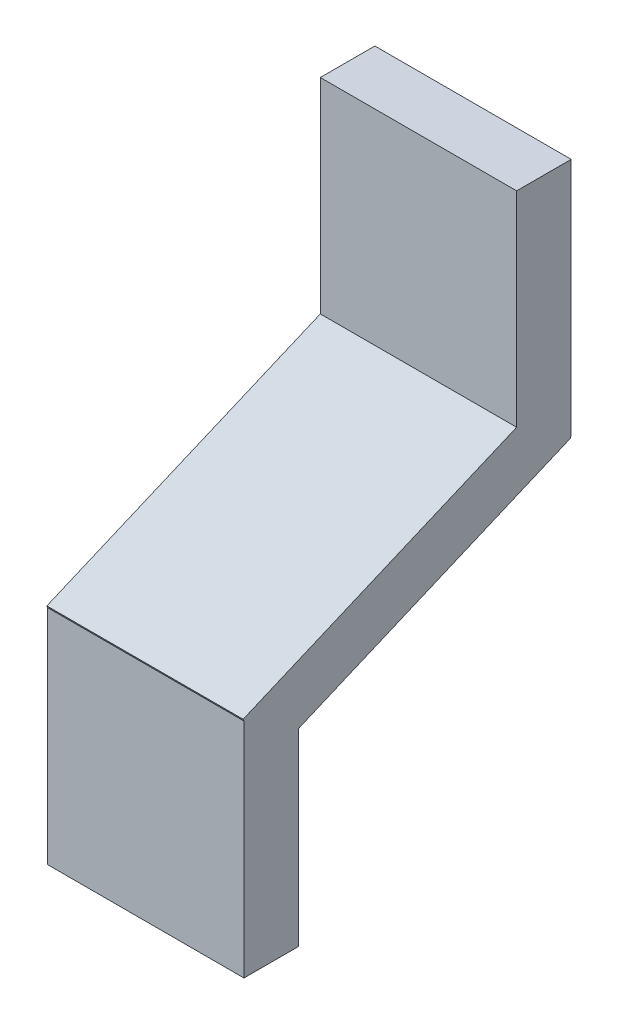
ISO-10303-21;
HEADER;
FILE_DESCRIPTION(('STEP AP214'),'2;1');
FILE_NAME('part.step','',(''),(''),'','','');
FILE_SCHEMA(('AUTOMOTIVE_DESIGN { 1 0 10303 214 1 1 1 1 }'));
ENDSEC;
DATA;
#1=APPLICATION_CONTEXT('core data for automotive mechanical design processes');
#2=APPLICATION_PROTOCOL_DEFINITION('international standard','automotive_design',2000,#1);
#3=PRODUCT_CONTEXT('',#1,'mechanical');
#4=PRODUCT('Part','Part','',(#3));
#5=PRODUCT_RELATED_PRODUCT_CATEGORY('part','',(#4));
#6=PRODUCT_DEFINITION_FORMATION('','',#4);
#7=PRODUCT_DEFINITION_CONTEXT('part definition',#1,'design');
#8=PRODUCT_DEFINITION('design','',#6,#7);
#9=PRODUCT_DEFINITION_SHAPE('','',#8);
#10=(LENGTH_UNIT() NAMED_UNIT(*) SI_UNIT(.MILLI.,.METRE.));
#11=(NAMED_UNIT(*) PLANE_ANGLE_UNIT() SI_UNIT($,.RADIAN.));
#12=(NAMED_UNIT(*) SI_UNIT($,.STERADIAN.) SOLID_ANGLE_UNIT());
#13=UNCERTAINTY_MEASURE_WITH_UNIT(LENGTH_MEASURE(1.E-05),#10,'distance_accuracy_value','');
#14=(GEOMETRIC_REPRESENTATION_CONTEXT(3) GLOBAL_UNCERTAINTY_ASSIGNED_CONTEXT((#13)) GLOBAL_UNIT_ASSIGNED_CONTEXT((#10,
#11,#12)) REPRESENTATION_CONTEXT('',''));
#15=CARTESIAN_POINT('',(0.,0.,0.));
#16=DIRECTION('',(0.,0.,1.));
#17=DIRECTION('',(1.,0.,0.));
#18=AXIS2_PLACEMENT_3D('',#15,#16,#17);
#19=CARTESIAN_POINT('',(5.82,11.,0.5));
#20=DIRECTION('',(0.,0.,1.));
#21=DIRECTION('',(1.,0.,0.));
#22=AXIS2_PLACEMENT_3D('',#19,#20,#21);
#23=PLANE('',#22);
#24=DIRECTION('',(1.,0.,0.));
#25=VECTOR('',#24,1.);
#26=CARTESIAN_POINT('',(5.82,11.3461054439247,0.500000000000314));
#27=LINE('',#26,#25);
#28=CARTESIAN_POINT('',(6.180000014305,11.3461054439242,0.500000000000105));
#29=VERTEX_POINT('',#28);
#30=CARTESIAN_POINT('',(5.82,11.3461054439243,0.500000000000105));
#31=VERTEX_POINT('',#30);
#32=EDGE_CURVE('E148',#29,#31,#27,.F.);
#33=ORIENTED_EDGE('',*,*,#32,.F.);
#34=DIRECTION('',(0.,1.,0.));
#35=VECTOR('',#34,1.);
#36=CARTESIAN_POINT('',(6.180000014305,11.65,0.5));
#37=LINE('',#36,#35);
#38=CARTESIAN_POINT('',(6.180000014305,11.,0.5));
#39=VERTEX_POINT('',#38);
#40=EDGE_CURVE('E154',#39,#29,#37,.T.);
#41=ORIENTED_EDGE('',*,*,#40,.F.);
#42=DIRECTION('',(1.,0.,0.));
#43=VECTOR('',#42,1.);
#44=CARTESIAN_POINT('',(5.82,11.,0.5));
#45=LINE('',#44,#43);
#46=CARTESIAN_POINT('',(5.82,11.,0.5));
#47=VERTEX_POINT('',#46);
#48=EDGE_CURVE('E135',#39,#47,#45,.F.);
#49=ORIENTED_EDGE('',*,*,#48,.T.);
#50=DIRECTION('',(0.,1.,0.));
#51=VECTOR('',#50,1.);
#52=CARTESIAN_POINT('',(5.82,11.65,0.5));
#53=LINE('',#52,#51);
#54=EDGE_CURVE('E182',#47,#31,#53,.T.);
#55=ORIENTED_EDGE('',*,*,#54,.T.);
#56=EDGE_LOOP('',(#33,#41,#49,#55));
#57=FACE_BOUND('',#56,.T.);
#58=ADVANCED_FACE('F17',(#57),#23,.F.);
#59=CARTESIAN_POINT('',(5.82,11.557949520001,0.0009268707435866));
#60=DIRECTION('',(0.,-0.920504786278108,-0.390731286742046));
#61=DIRECTION('',(0.,0.390731286742046,-0.920504786278108));
#62=AXIS2_PLACEMENT_3D('',#59,#60,#61);
#63=PLANE('',#62);
#64=DIRECTION('',(0.,0.39073128674346,-0.920504786277508));
#65=VECTOR('',#64,1.);
#66=CARTESIAN_POINT('',(6.180000014305,11.346105443924,0.5));
#67=LINE('',#66,#65);
#68=CARTESIAN_POINT('',(6.180000014305,11.557949520001,0.000926870743687937));
#69=VERTEX_POINT('',#68);
#70=EDGE_CURVE('E151',#29,#69,#67,.T.);
#71=ORIENTED_EDGE('',*,*,#70,.F.);
#72=ORIENTED_EDGE('',*,*,#32,.T.);
#73=DIRECTION('',(0.,0.39073128674346,-0.920504786277508));
#74=VECTOR('',#73,1.);
#75=CARTESIAN_POINT('',(5.82,11.346105443924,0.5));
#76=LINE('',#75,#74);
#77=CARTESIAN_POINT('',(5.82,11.557949520001,0.000926870743697301));
#78=VERTEX_POINT('',#77);
#79=EDGE_CURVE('E178',#31,#78,#76,.T.);
#80=ORIENTED_EDGE('',*,*,#79,.T.);
#81=DIRECTION('',(1.,0.,0.));
#82=VECTOR('',#81,1.);
#83=CARTESIAN_POINT('',(5.82,11.557949520001,0.00092687074374427));
#84=LINE('',#83,#82);
#85=EDGE_CURVE('E145',#78,#69,#84,.T.);
#86=ORIENTED_EDGE('',*,*,#85,.T.);
#87=EDGE_LOOP('',(#71,#72,#80,#86));
#88=FACE_BOUND('',#87,.T.);
#89=ADVANCED_FACE('F242',(#88),#63,.T.);
#90=CARTESIAN_POINT('',(5.82,11.65,0.04));
#91=DIRECTION('',(0.,-0.390731286742046,0.920504786278108));
#92=DIRECTION('',(0.,-0.920504786278108,-0.390731286742046));
#93=AXIS2_PLACEMENT_3D('',#90,#91,#92);
#94=PLANE('',#93);
#95=DIRECTION('',(0.,0.920504786259214,0.390731286786557));
#96=VECTOR('',#95,1.);
#97=CARTESIAN_POINT('',(5.82,11.557949520001,0.000926870743659899));
#98=LINE('',#97,#96);
#99=CARTESIAN_POINT('',(5.82,11.56,0.001797248280528));
#100=VERTEX_POINT('',#99);
#101=EDGE_CURVE('E123',#78,#100,#98,.T.);
#102=ORIENTED_EDGE('',*,*,#101,.T.);
#103=DIRECTION('',(1.,0.,0.));
#104=VECTOR('',#103,1.);
#105=CARTESIAN_POINT('',(5.82,11.56,0.001797248280528));
#106=LINE('',#105,#104);
#107=CARTESIAN_POINT('',(6.180000014305,11.56,0.001797248280528));
#108=VERTEX_POINT('',#107);
#109=EDGE_CURVE('E97',#100,#108,#106,.T.);
#110=ORIENTED_EDGE('',*,*,#109,.T.);
#111=DIRECTION('',(0.,0.920504786259214,0.390731286786557));
#112=VECTOR('',#111,1.);
#113=CARTESIAN_POINT('',(6.180000014305,11.557949520001,0.000926870743659899));
#114=LINE('',#113,#112);
#115=EDGE_CURVE('E153',#69,#108,#114,.T.);
#116=ORIENTED_EDGE('',*,*,#115,.F.);
#117=ORIENTED_EDGE('',*,*,#85,.F.);
#118=EDGE_LOOP('',(#102,#110,#116,#117));
#119=FACE_BOUND('',#118,.T.);
#120=ADVANCED_FACE('F243',(#119),#94,.F.);
#121=CARTESIAN_POINT('',(5.82,11.56,0.));
#122=DIRECTION('',(0.,1.,0.));
#123=DIRECTION('',(0.,0.,1.));
#124=AXIS2_PLACEMENT_3D('',#121,#122,#123);
#125=PLANE('',#124);
#126=ORIENTED_EDGE('',*,*,#109,.F.);
#127=DIRECTION('',(0.,0.,1.));
#128=VECTOR('',#127,1.);
#129=CARTESIAN_POINT('',(5.82,11.56,0.));
#130=LINE('',#129,#128);
#131=CARTESIAN_POINT('',(5.82,11.56,0.));
#132=VERTEX_POINT('',#131);
#133=EDGE_CURVE('E20',#100,#132,#130,.F.);
#134=ORIENTED_EDGE('',*,*,#133,.T.);
#135=DIRECTION('',(1.,0.,0.));
#136=VECTOR('',#135,1.);
#137=CARTESIAN_POINT('',(5.82,11.56,0.));
#138=LINE('',#137,#136);
#139=CARTESIAN_POINT('',(6.180000014305,11.56,0.));
#140=VERTEX_POINT('',#139);
#141=EDGE_CURVE('E104',#132,#140,#138,.T.);
#142=ORIENTED_EDGE('',*,*,#141,.T.);
#143=DIRECTION('',(0.,0.,-1.));
#144=VECTOR('',#143,1.);
#145=CARTESIAN_POINT('',(6.180000014305,11.56,0.04));
#146=LINE('',#145,#144);
#147=EDGE_CURVE('E194',#108,#140,#146,.T.);
#148=ORIENTED_EDGE('',*,*,#147,.F.);
#149=EDGE_LOOP('',(#126,#134,#142,#148));
#150=FACE_BOUND('',#149,.T.);
#151=ADVANCED_FACE('F122',(#150),#125,.F.);
#152=CARTESIAN_POINT('',(5.82,11.56,0.));
#153=DIRECTION('',(0.,0.,1.));
#154=DIRECTION('',(1.,0.,0.));
#155=AXIS2_PLACEMENT_3D('',#152,#153,#154);
#156=PLANE('',#155);
#157=ORIENTED_EDGE('',*,*,#141,.F.);
#158=DIRECTION('',(0.,1.,0.));
#159=VECTOR('',#158,1.);
#160=CARTESIAN_POINT('',(5.82,11.65,0.));
#161=LINE('',#160,#159);
#162=CARTESIAN_POINT('',(5.82,11.999999997616,0.));
#163=VERTEX_POINT('',#162);
#164=EDGE_CURVE('E108',#132,#163,#161,.T.);
#165=ORIENTED_EDGE('',*,*,#164,.T.);
#166=DIRECTION('',(1.,0.,0.));
#167=VECTOR('',#166,1.);
#168=CARTESIAN_POINT('',(5.82,11.999999997616,0.));
#169=LINE('',#168,#167);
#170=CARTESIAN_POINT('',(6.180000014305,11.999999997616,0.));
#171=VERTEX_POINT('',#170);
#172=EDGE_CURVE('E110',#171,#163,#169,.F.);
#173=ORIENTED_EDGE('',*,*,#172,.F.);
#174=DIRECTION('',(0.,1.,0.));
#175=VECTOR('',#174,1.);
#176=CARTESIAN_POINT('',(6.180000014305,11.65,0.));
#177=LINE('',#176,#175);
#178=EDGE_CURVE('E109',#140,#171,#177,.T.);
#179=ORIENTED_EDGE('',*,*,#178,.F.);
#180=EDGE_LOOP('',(#157,#165,#173,#179));
#181=FACE_BOUND('',#180,.T.);
#182=ADVANCED_FACE('F106',(#181),#156,.F.);
#183=CARTESIAN_POINT('',(5.82,11.999999997616,0.));
#184=DIRECTION('',(0.,1.,0.));
#185=DIRECTION('',(0.,0.,1.));
#186=AXIS2_PLACEMENT_3D('',#183,#184,#185);
#187=PLANE('',#186);
#188=ORIENTED_EDGE('',*,*,#172,.T.);
#189=DIRECTION('',(0.,0.,-1.));
#190=VECTOR('',#189,1.);
#191=CARTESIAN_POINT('',(5.82,11.999999997616,0.04));
#192=LINE('',#191,#190);
#193=CARTESIAN_POINT('',(5.82,11.999999997616,0.10000000149));
#194=VERTEX_POINT('',#193);
#195=EDGE_CURVE('E120',#163,#194,#192,.F.);
#196=ORIENTED_EDGE('',*,*,#195,.T.);
#197=DIRECTION('',(1.,0.,0.));
#198=VECTOR('',#197,1.);
#199=CARTESIAN_POINT('',(5.82,11.999999997616,0.10000000149));
#200=LINE('',#199,#198);
#201=CARTESIAN_POINT('',(6.180000014305,11.999999997616,0.10000000149));
#202=VERTEX_POINT('',#201);
#203=EDGE_CURVE('E181',#202,#194,#200,.F.);
#204=ORIENTED_EDGE('',*,*,#203,.F.);
#205=DIRECTION('',(0.,0.,-1.));
#206=VECTOR('',#205,1.);
#207=CARTESIAN_POINT('',(6.180000014305,11.999999997616,0.04));
#208=LINE('',#207,#206);
#209=EDGE_CURVE('E140',#171,#202,#208,.F.);
#210=ORIENTED_EDGE('',*,*,#209,.F.);
#211=EDGE_LOOP('',(#188,#196,#204,#210));
#212=FACE_BOUND('',#211,.T.);
#213=ADVANCED_FACE('F271',(#212),#187,.T.);
#214=CARTESIAN_POINT('',(5.82,11.,0.60000000149));
#215=DIRECTION('',(0.,0.,1.));
#216=DIRECTION('',(1.,0.,0.));
#217=AXIS2_PLACEMENT_3D('',#214,#215,#216);
#218=PLANE('',#217);
#219=DIRECTION('',(0.,1.,0.));
#220=VECTOR('',#219,1.);
#221=CARTESIAN_POINT('',(6.180000014305,11.65,0.60000000149));
#222=LINE('',#221,#220);
#223=CARTESIAN_POINT('',(6.180000014305,11.408101447657,0.600000001490072));
#224=VERTEX_POINT('',#223);
#225=CARTESIAN_POINT('',(6.180000014305,11.,0.60000000149));
#226=VERTEX_POINT('',#225);
#227=EDGE_CURVE('E168',#224,#226,#222,.F.);
#228=ORIENTED_EDGE('',*,*,#227,.F.);
#229=DIRECTION('',(1.,0.,0.));
#230=VECTOR('',#229,1.);
#231=CARTESIAN_POINT('',(5.82,11.4081014476569,0.600000001490144));
#232=LINE('',#231,#230);
#233=CARTESIAN_POINT('',(5.82,11.408101447657,0.600000001490072));
#234=VERTEX_POINT('',#233);
#235=EDGE_CURVE('E124',#234,#224,#232,.T.);
#236=ORIENTED_EDGE('',*,*,#235,.F.);
#237=DIRECTION('',(0.,1.,0.));
#238=VECTOR('',#237,1.);
#239=CARTESIAN_POINT('',(5.82,11.65,0.60000000149));
#240=LINE('',#239,#238);
#241=CARTESIAN_POINT('',(5.82,11.,0.60000000149));
#242=VERTEX_POINT('',#241);
#243=EDGE_CURVE('E192',#234,#242,#240,.F.);
#244=ORIENTED_EDGE('',*,*,#243,.T.);
#245=DIRECTION('',(1.,0.,0.));
#246=VECTOR('',#245,1.);
#247=CARTESIAN_POINT('',(5.82,11.,0.60000000149));
#248=LINE('',#247,#246);
#249=EDGE_CURVE('E127',#242,#226,#248,.T.);
#250=ORIENTED_EDGE('',*,*,#249,.T.);
#251=EDGE_LOOP('',(#228,#236,#244,#250));
#252=FACE_BOUND('',#251,.T.);
#253=ADVANCED_FACE('F232',(#252),#218,.T.);
#254=CARTESIAN_POINT('',(5.82,11.,0.5));
#255=DIRECTION('',(0.,1.,0.));
#256=DIRECTION('',(0.,0.,1.));
#257=AXIS2_PLACEMENT_3D('',#254,#255,#256);
#258=PLANE('',#257);
#259=DIRECTION('',(0.,0.,-1.));
#260=VECTOR('',#259,1.);
#261=CARTESIAN_POINT('',(5.82,11.,0.04));
#262=LINE('',#261,#260);
#263=EDGE_CURVE('E187',#242,#47,#262,.T.);
#264=ORIENTED_EDGE('',*,*,#263,.T.);
#265=ORIENTED_EDGE('',*,*,#48,.F.);
#266=DIRECTION('',(0.,0.,-1.));
#267=VECTOR('',#266,1.);
#268=CARTESIAN_POINT('',(6.180000014305,11.,0.04));
#269=LINE('',#268,#267);
#270=EDGE_CURVE('E164',#226,#39,#269,.T.);
#271=ORIENTED_EDGE('',*,*,#270,.F.);
#272=ORIENTED_EDGE('',*,*,#249,.F.);
#273=EDGE_LOOP('',(#264,#265,#271,#272));
#274=FACE_BOUND('',#273,.T.);
#275=ADVANCED_FACE('F235',(#274),#258,.F.);
#276=CARTESIAN_POINT('',(5.82,11.411653909498,0.601507932798));
#277=DIRECTION('',(0.,-0.390731286742046,0.920504786278108));
#278=DIRECTION('',(0.,-0.920504786278108,-0.390731286742046));
#279=AXIS2_PLACEMENT_3D('',#276,#277,#278);
#280=PLANE('',#279);
#281=ORIENTED_EDGE('',*,*,#235,.T.);
#282=DIRECTION('',(0.,-0.920504786262243,-0.390731286779422));
#283=VECTOR('',#282,1.);
#284=CARTESIAN_POINT('',(6.180000014305,11.411653909498,0.601507932798));
#285=LINE('',#284,#283);
#286=CARTESIAN_POINT('',(6.180000014305,11.4116539094979,0.601507932797974));
#287=VERTEX_POINT('',#286);
#288=EDGE_CURVE('E227',#287,#224,#285,.T.);
#289=ORIENTED_EDGE('',*,*,#288,.F.);
#290=DIRECTION('',(1.,0.,0.));
#291=VECTOR('',#290,1.);
#292=CARTESIAN_POINT('',(5.82,11.4116539094978,0.601507932797897));
#293=LINE('',#292,#291);
#294=CARTESIAN_POINT('',(5.82,11.4116539094979,0.601507932797974));
#295=VERTEX_POINT('',#294);
#296=EDGE_CURVE('E167',#287,#295,#293,.F.);
#297=ORIENTED_EDGE('',*,*,#296,.T.);
#298=DIRECTION('',(0.,-0.920504786262243,-0.390731286779422));
#299=VECTOR('',#298,1.);
#300=CARTESIAN_POINT('',(5.82,11.411653909498,0.601507932798));
#301=LINE('',#300,#299);
#302=EDGE_CURVE('E175',#295,#234,#301,.T.);
#303=ORIENTED_EDGE('',*,*,#302,.T.);
#304=EDGE_LOOP('',(#281,#289,#297,#303));
#305=FACE_BOUND('',#304,.T.);
#306=ADVANCED_FACE('F210',(#305),#280,.T.);
#307=CARTESIAN_POINT('',(5.82,11.65,0.04));
#308=DIRECTION('',(1.,0.,0.));
#309=DIRECTION('',(0.,0.,-1.));
#310=AXIS2_PLACEMENT_3D('',#307,#308,#309);
#311=PLANE('',#310);
#312=ORIENTED_EDGE('',*,*,#54,.F.);
#313=ORIENTED_EDGE('',*,*,#263,.F.);
#314=ORIENTED_EDGE('',*,*,#243,.F.);
#315=ORIENTED_EDGE('',*,*,#302,.F.);
#316=DIRECTION('',(0.,0.390731286742046,-0.920504786278108));
#317=VECTOR('',#316,1.);
#318=CARTESIAN_POINT('',(5.82,11.65,0.04));
#319=LINE('',#318,#317);
#320=CARTESIAN_POINT('',(5.82,11.624531498221,0.100000001490019));
#321=VERTEX_POINT('',#320);
#322=EDGE_CURVE('E216',#295,#321,#319,.T.);
#323=ORIENTED_EDGE('',*,*,#322,.T.);
#324=DIRECTION('',(0.,1.,0.));
#325=VECTOR('',#324,1.);
#326=CARTESIAN_POINT('',(5.82,11.56,0.10000000149));
#327=LINE('',#326,#325);
#328=EDGE_CURVE('E161',#194,#321,#327,.F.);
#329=ORIENTED_EDGE('',*,*,#328,.F.);
#330=ORIENTED_EDGE('',*,*,#195,.F.);
#331=ORIENTED_EDGE('',*,*,#164,.F.);
#332=ORIENTED_EDGE('',*,*,#133,.F.);
#333=ORIENTED_EDGE('',*,*,#101,.F.);
#334=ORIENTED_EDGE('',*,*,#79,.F.);
#335=EDGE_LOOP('',(#312,#313,#314,#315,#323,#329,#330,#331,#332,#333,#334));
#336=FACE_BOUND('',#335,.T.);
#337=ADVANCED_FACE('F115',(#336),#311,.F.);
#338=CARTESIAN_POINT('',(5.82,11.56,0.10000000149));
#339=DIRECTION('',(0.,0.,1.));
#340=DIRECTION('',(1.,0.,0.));
#341=AXIS2_PLACEMENT_3D('',#338,#339,#340);
#342=PLANE('',#341);
#343=ORIENTED_EDGE('',*,*,#328,.T.);
#344=DIRECTION('',(1.,0.,0.));
#345=VECTOR('',#344,1.);
#346=CARTESIAN_POINT('',(5.82,11.6245314982212,0.100000001490075));
#347=LINE('',#346,#345);
#348=CARTESIAN_POINT('',(6.180000014305,11.624531498221,0.100000001490019));
#349=VERTEX_POINT('',#348);
#350=EDGE_CURVE('E26',#321,#349,#347,.T.);
#351=ORIENTED_EDGE('',*,*,#350,.T.);
#352=DIRECTION('',(0.,1.,0.));
#353=VECTOR('',#352,1.);
#354=CARTESIAN_POINT('',(6.180000014305,11.65,0.10000000149));
#355=LINE('',#354,#353);
#356=EDGE_CURVE('E34',#202,#349,#355,.F.);
#357=ORIENTED_EDGE('',*,*,#356,.F.);
#358=ORIENTED_EDGE('',*,*,#203,.T.);
#359=EDGE_LOOP('',(#343,#351,#357,#358));
#360=FACE_BOUND('',#359,.T.);
#361=ADVANCED_FACE('F257',(#360),#342,.T.);
#362=CARTESIAN_POINT('',(6.180000014305,11.65,0.04));
#363=DIRECTION('',(1.,0.,0.));
#364=DIRECTION('',(0.,0.,-1.));
#365=AXIS2_PLACEMENT_3D('',#362,#363,#364);
#366=PLANE('',#365);
#367=ORIENTED_EDGE('',*,*,#227,.T.);
#368=ORIENTED_EDGE('',*,*,#270,.T.);
#369=ORIENTED_EDGE('',*,*,#40,.T.);
#370=ORIENTED_EDGE('',*,*,#70,.T.);
#371=ORIENTED_EDGE('',*,*,#115,.T.);
#372=ORIENTED_EDGE('',*,*,#147,.T.);
#373=ORIENTED_EDGE('',*,*,#178,.T.);
#374=ORIENTED_EDGE('',*,*,#209,.T.);
#375=ORIENTED_EDGE('',*,*,#356,.T.);
#376=DIRECTION('',(0.,0.390731286742046,-0.920504786278108));
#377=VECTOR('',#376,1.);
#378=CARTESIAN_POINT('',(6.180000014305,11.65,0.04));
#379=LINE('',#378,#377);
#380=EDGE_CURVE('E11',#349,#287,#379,.F.);
#381=ORIENTED_EDGE('',*,*,#380,.T.);
#382=ORIENTED_EDGE('',*,*,#288,.T.);
#383=EDGE_LOOP('',(#367,#368,#369,#370,#371,#372,#373,#374,#375,#381,#382));
#384=FACE_BOUND('',#383,.T.);
#385=ADVANCED_FACE('F230',(#384),#366,.T.);
#386=CARTESIAN_POINT('',(5.82,11.65,0.04));
#387=DIRECTION('',(0.,-0.920504786278108,-0.390731286742046));
#388=DIRECTION('',(0.,0.390731286742046,-0.920504786278108));
#389=AXIS2_PLACEMENT_3D('',#386,#387,#388);
#390=PLANE('',#389);
#391=ORIENTED_EDGE('',*,*,#350,.F.);
#392=ORIENTED_EDGE('',*,*,#322,.F.);
#393=ORIENTED_EDGE('',*,*,#296,.F.);
#394=ORIENTED_EDGE('',*,*,#380,.F.);
#395=EDGE_LOOP('',(#391,#392,#393,#394));
#396=FACE_BOUND('',#395,.T.);
#397=ADVANCED_FACE('F220',(#396),#390,.F.);
#398=CLOSED_SHELL('',(#58,#89,#120,#151,#182,#213,#253,#275,#306,#337,#361,#385,#397));
#399=MANIFOLD_SOLID_BREP('B1',#398);
#400=ADVANCED_BREP_SHAPE_REPRESENTATION('',(#18,#399),#14);
#401=SHAPE_DEFINITION_REPRESENTATION(#9,#400);
ENDSEC;
END-ISO-10303-21;
